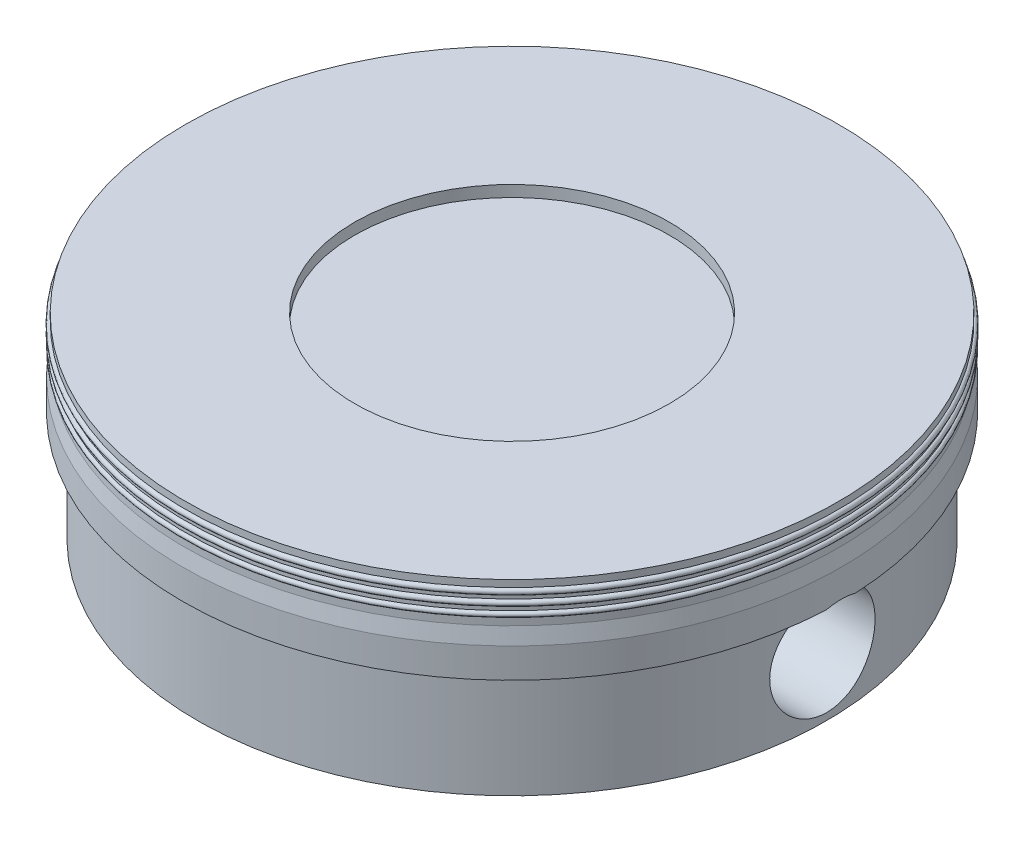
ISO-10303-21;
HEADER;
FILE_DESCRIPTION(('STEP AP214'),'2;1');
FILE_NAME('part.step','',(''),(''),'','','');
FILE_SCHEMA(('AUTOMOTIVE_DESIGN { 1 0 10303 214 1 1 1 1 }'));
ENDSEC;
DATA;
#1=APPLICATION_CONTEXT('core data for automotive mechanical design processes');
#2=APPLICATION_PROTOCOL_DEFINITION('international standard','automotive_design',2000,#1);
#3=PRODUCT_CONTEXT('',#1,'mechanical');
#4=PRODUCT('Part','Part','',(#3));
#5=PRODUCT_RELATED_PRODUCT_CATEGORY('part','',(#4));
#6=PRODUCT_DEFINITION_FORMATION('','',#4);
#7=PRODUCT_DEFINITION_CONTEXT('part definition',#1,'design');
#8=PRODUCT_DEFINITION('design','',#6,#7);
#9=PRODUCT_DEFINITION_SHAPE('','',#8);
#10=(LENGTH_UNIT() NAMED_UNIT(*) SI_UNIT(.MILLI.,.METRE.));
#11=(NAMED_UNIT(*) PLANE_ANGLE_UNIT() SI_UNIT($,.RADIAN.));
#12=(NAMED_UNIT(*) SI_UNIT($,.STERADIAN.) SOLID_ANGLE_UNIT());
#13=UNCERTAINTY_MEASURE_WITH_UNIT(LENGTH_MEASURE(1.E-05),#10,'distance_accuracy_value','');
#14=(GEOMETRIC_REPRESENTATION_CONTEXT(3) GLOBAL_UNCERTAINTY_ASSIGNED_CONTEXT((#13)) GLOBAL_UNIT_ASSIGNED_CONTEXT((#10,
#11,#12)) REPRESENTATION_CONTEXT('',''));
#15=CARTESIAN_POINT('',(0.,0.,0.));
#16=DIRECTION('',(0.,0.,1.));
#17=DIRECTION('',(1.,0.,0.));
#18=AXIS2_PLACEMENT_3D('',#15,#16,#17);
#19=CARTESIAN_POINT('',(5.00002397319986,16.3941782883623,-8.45895883470329E-08));
#20=DIRECTION('',(0.,1.,0.));
#21=DIRECTION('',(-1.,0.,0.));
#22=AXIS2_PLACEMENT_3D('',#19,#20,#21);
#23=PLANE('',#22);
#24=CARTESIAN_POINT('',(2.39731998639205E-05,16.3941782883623,-8.45895883470329E-08));
#25=DIRECTION('',(0.,1.,0.));
#26=DIRECTION('',(-1.,0.,0.));
#27=AXIS2_PLACEMENT_3D('',#24,#25,#26);
#28=CIRCLE('',#27,5.);
#29=CARTESIAN_POINT('',(-4.99503280825918,16.3941782883623,0.222278456884839));
#30=VERTEX_POINT('',#29);
#31=CARTESIAN_POINT('',(4.99508075465891,16.3941782883623,0.222278456884839));
#32=VERTEX_POINT('',#31);
#33=EDGE_CURVE('E144',#30,#32,#28,.T.);
#34=ORIENTED_EDGE('',*,*,#33,.F.);
#35=DIRECTION('',(1.,0.,0.));
#36=VECTOR('',#35,1.);
#37=CARTESIAN_POINT('',(-5.0051424957185,16.3941782883623,0.222278456884839));
#38=LINE('',#37,#36);
#39=CARTESIAN_POINT('',(-4.77480505515288,16.3941782883623,0.222278456884839));
#40=VERTEX_POINT('',#39);
#41=EDGE_CURVE('E70',#30,#40,#38,.T.);
#42=ORIENTED_EDGE('',*,*,#41,.T.);
#43=CARTESIAN_POINT('',(2.39731998639205E-05,16.3941782883623,-8.45895883470329E-08));
#44=DIRECTION('',(0.,1.,0.));
#45=DIRECTION('',(-1.,0.,0.));
#46=AXIS2_PLACEMENT_3D('',#43,#44,#45);
#47=CIRCLE('',#46,4.78);
#48=CARTESIAN_POINT('',(4.77485300155261,16.3941782883623,0.222278456884839));
#49=VERTEX_POINT('',#48);
#50=EDGE_CURVE('E11',#40,#49,#47,.T.);
#51=ORIENTED_EDGE('',*,*,#50,.T.);
#52=EDGE_CURVE('E271',#49,#32,#38,.T.);
#53=ORIENTED_EDGE('',*,*,#52,.T.);
#54=EDGE_LOOP('',(#34,#42,#51,#53));
#55=FACE_BOUND('',#54,.T.);
#56=ADVANCED_FACE('F44',(#55),#23,.F.);
#57=CARTESIAN_POINT('',(2.39731998640258E-05,17.7191782883623,-8.45895883470329E-08));
#58=DIRECTION('',(0.,1.,0.));
#59=DIRECTION('',(-1.,0.,0.));
#60=AXIS2_PLACEMENT_3D('',#57,#58,#59);
#61=CYLINDRICAL_SURFACE('',#60,3.43);
#62=CARTESIAN_POINT('',(2.39731998639407E-05,16.6491782883623,-8.45895883470329E-08));
#63=DIRECTION('',(0.,1.,0.));
#64=DIRECTION('',(-1.,0.,0.));
#65=AXIS2_PLACEMENT_3D('',#62,#63,#64);
#66=CIRCLE('',#65,3.43);
#67=CARTESIAN_POINT('',(-1.74997602680014,16.6491782883623,2.94998296620918));
#68=VERTEX_POINT('',#67);
#69=CARTESIAN_POINT('',(1.75002397319986,16.6491782883623,2.94998296620918));
#70=VERTEX_POINT('',#69);
#71=EDGE_CURVE('E200',#68,#70,#66,.T.);
#72=ORIENTED_EDGE('',*,*,#71,.T.);
#73=DIRECTION('',(0.,-1.,0.));
#74=VECTOR('',#73,1.);
#75=CARTESIAN_POINT('',(1.75002397319986,17.6913782883623,2.94998296620918));
#76=LINE('',#75,#74);
#77=CARTESIAN_POINT('',(1.75002397319986,14.7191782883623,2.94998296620918));
#78=VERTEX_POINT('',#77);
#79=EDGE_CURVE('E258',#70,#78,#76,.T.);
#80=ORIENTED_EDGE('',*,*,#79,.T.);
#81=CARTESIAN_POINT('',(2.39731998637873E-05,14.7191782883623,-8.45895883470329E-08));
#82=DIRECTION('',(0.,1.,0.));
#83=DIRECTION('',(-1.,0.,0.));
#84=AXIS2_PLACEMENT_3D('',#81,#82,#83);
#85=CIRCLE('',#84,3.43);
#86=CARTESIAN_POINT('',(-1.74997602680014,14.7191782883623,2.94998296620918));
#87=VERTEX_POINT('',#86);
#88=EDGE_CURVE('E205',#87,#78,#85,.T.);
#89=ORIENTED_EDGE('',*,*,#88,.F.);
#90=DIRECTION('',(0.,-1.,0.));
#91=VECTOR('',#90,1.);
#92=CARTESIAN_POINT('',(-1.74997602680014,17.6913782883623,2.94998296620918));
#93=LINE('',#92,#91);
#94=EDGE_CURVE('E223',#68,#87,#93,.T.);
#95=ORIENTED_EDGE('',*,*,#94,.F.);
#96=EDGE_LOOP('',(#72,#80,#89,#95));
#97=FACE_BOUND('',#96,.T.);
#98=ADVANCED_FACE('F311',(#97),#61,.F.);
#99=CARTESIAN_POINT('',(2.39731998640258E-05,17.7191782883623,-8.45895883470329E-08));
#100=DIRECTION('',(0.,1.,0.));
#101=DIRECTION('',(-1.,0.,0.));
#102=AXIS2_PLACEMENT_3D('',#99,#100,#101);
#103=CYLINDRICAL_SURFACE('',#102,4.78);
#104=ORIENTED_EDGE('',*,*,#50,.F.);
#105=CARTESIAN_POINT('',(-4.77480505515288,16.3941782883623,0.222278456884839));
#106=CARTESIAN_POINT('',(-4.77280669108975,16.3816958887688,0.265565519759989));
#107=CARTESIAN_POINT('',(-4.77023725644197,16.3655034716094,0.30773064911584));
#108=CARTESIAN_POINT('',(-4.76431560364256,16.3263434688303,0.388679653843705));
#109=CARTESIAN_POINT('',(-4.76096416574928,16.3033826305546,0.427466846984932));
#110=CARTESIAN_POINT('',(-4.75383186240648,16.2512988698889,0.500619264751559));
#111=CARTESIAN_POINT('',(-4.7500509230328,16.2221748859752,0.534983725975479));
#112=CARTESIAN_POINT('',(-4.74248542764722,16.1585871188541,0.598348968178687));
#113=CARTESIAN_POINT('',(-4.73870087185624,16.1241236434017,0.62735005807813));
#114=CARTESIAN_POINT('',(-4.73153105199467,16.0505967978468,0.679324649147275));
#115=CARTESIAN_POINT('',(-4.72814803519442,16.0115097784166,0.7022650332023));
#116=CARTESIAN_POINT('',(-4.7221940900473,15.9299717909658,0.741247005562128));
#117=CARTESIAN_POINT('',(-4.7196232068545,15.8875206360657,0.757288210295281));
#118=CARTESIAN_POINT('',(-4.71561004607263,15.8007929602562,0.781889542998554));
#119=CARTESIAN_POINT('',(-4.71415951486775,15.7565323678611,0.790504436248471));
#120=CARTESIAN_POINT('',(-4.71252603386343,15.6671738010784,0.800185690690471));
#121=CARTESIAN_POINT('',(-4.71234291934102,15.6220759362729,0.801253032819334));
#122=CARTESIAN_POINT('',(-4.7132599560872,15.5328769879509,0.795839970430003));
#123=CARTESIAN_POINT('',(-4.71434524129296,15.4887704103273,0.789447004499236));
#124=CARTESIAN_POINT('',(-4.71764953379241,15.402267007407,0.769453112958443));
#125=CARTESIAN_POINT('',(-4.71986858235978,15.3598702444154,0.755851924938632));
#126=CARTESIAN_POINT('',(-4.7251951772583,15.2778617248379,0.721803093605542));
#127=CARTESIAN_POINT('',(-4.72830488823174,15.2382570499007,0.701338749291105));
#128=CARTESIAN_POINT('',(-4.7350629086676,15.1630186310224,0.654154523286948));
#129=CARTESIAN_POINT('',(-4.73871125949659,15.1273851924341,0.627434161054111));
#130=CARTESIAN_POINT('',(-4.74619261204456,15.0606223274712,0.568094463058484));
#131=CARTESIAN_POINT('',(-4.75002736759582,15.0295556854415,0.53540467832031));
#132=CARTESIAN_POINT('',(-4.75740997643784,14.9733312091637,0.465256660119838));
#133=CARTESIAN_POINT('',(-4.76095782259372,14.9481735218303,0.427798308132122));
#134=CARTESIAN_POINT('',(-4.76738145792898,14.9044110350176,0.349013505367648));
#135=CARTESIAN_POINT('',(-4.77025500818989,14.885827964909,0.307674788962026));
#136=CARTESIAN_POINT('',(-4.7749899259292,14.8558875371759,0.222404116923841));
#137=CARTESIAN_POINT('',(-4.77685137317378,14.8445296101092,0.178472365956962));
#138=CARTESIAN_POINT('',(-4.77933648991169,14.8294738542403,0.0897762342545006));
#139=CARTESIAN_POINT('',(-4.77997347486101,14.8256936021919,0.0450262158315295));
#140=CARTESIAN_POINT('',(-4.77997856283902,14.8256630695401,-0.0444749829692401));
#141=CARTESIAN_POINT('',(-4.77934673237908,14.8294123942357,-0.0892261631631699));
#142=CARTESIAN_POINT('',(-4.77689535932621,14.844262556971,-0.177083626135516));
#143=CARTESIAN_POINT('',(-4.77508542398646,14.8553039400248,-0.220200254382042));
#144=CARTESIAN_POINT('',(-4.77048608560248,14.8843480365439,-0.303965157722445));
#145=CARTESIAN_POINT('',(-4.76769663791794,14.9023510672832,-0.344613320219398));
#146=CARTESIAN_POINT('',(-4.76141950127179,14.9449513197157,-0.422610370722021));
#147=CARTESIAN_POINT('',(-4.75792699345644,14.9695944714633,-0.459933773287706));
#148=CARTESIAN_POINT('',(-4.75063888437633,15.0247271584847,-0.529946763729266));
#149=CARTESIAN_POINT('',(-4.7468432596472,15.0552171466206,-0.562635992327592));
#150=CARTESIAN_POINT('',(-4.73932198329045,15.1215973129025,-0.622842770847944));
#151=CARTESIAN_POINT('',(-4.73559764185306,15.1575456662741,-0.650296390484024));
#152=CARTESIAN_POINT('',(-4.72868665910591,15.2335871682175,-0.698783136368884));
#153=CARTESIAN_POINT('',(-4.72550001386543,15.2736802864866,-0.71981630955379));
#154=CARTESIAN_POINT('',(-4.72003650591244,15.3568172718967,-0.754814012095185));
#155=CARTESIAN_POINT('',(-4.71775802686867,15.399855735517,-0.768791111603112));
#156=CARTESIAN_POINT('',(-4.71436987508637,15.4877134993989,-0.789303653559921));
#157=CARTESIAN_POINT('',(-4.71326007400948,15.5325326035583,-0.795839913131002));
#158=CARTESIAN_POINT('',(-4.71234635539527,15.6220730916451,-0.80123244862053));
#159=CARTESIAN_POINT('',(-4.71252610122047,15.6667885438812,-0.800184799825682));
#160=CARTESIAN_POINT('',(-4.71413184036416,15.7554009708773,-0.790669261853999));
#161=CARTESIAN_POINT('',(-4.71555787542941,15.7992979181697,-0.782201124114232));
#162=CARTESIAN_POINT('',(-4.71948434379134,15.8848709088494,-0.758147570603225));
#163=CARTESIAN_POINT('',(-4.72198087784179,15.926554401289,-0.742587972357526));
#164=CARTESIAN_POINT('',(-4.7277657747901,16.0067244316034,-0.704817474038438));
#165=CARTESIAN_POINT('',(-4.73105409650208,16.0452111356233,-0.682606919908617));
#166=CARTESIAN_POINT('',(-4.73809739985523,16.1183615923966,-0.631874866887768));
#167=CARTESIAN_POINT('',(-4.74185713477228,16.1529784236136,-0.60328637067043));
#168=CARTESIAN_POINT('',(-4.74939752966274,16.216959948701,-0.540730742093716));
#169=CARTESIAN_POINT('',(-4.75317819325455,16.2463237031366,-0.506762649716964));
#170=CARTESIAN_POINT('',(-4.76045425905028,16.2998363845848,-0.43317669504273));
#171=CARTESIAN_POINT('',(-4.76393630467713,16.3237835772609,-0.393410497799578));
#172=CARTESIAN_POINT('',(-4.77008383415393,16.3645330489253,-0.31025568984645));
#173=CARTESIAN_POINT('',(-4.77274829221484,16.3813263624435,-0.266862614765071));
#174=CARTESIAN_POINT('',(-4.77480505515288,16.3941782883623,-0.222278626064016));
#175=B_SPLINE_CURVE_WITH_KNOTS('',3,(#105,#106,#107,#108,#109,#110,#111,#112,#113,#114,#115,
#116,#117,#118,#119,#120,#121,#122,#123,#124,#125,#126,#127,#128,#129,#130,#131,#132,#133,#134,
#135,#136,#137,#138,#139,#140,#141,#142,#143,#144,#145,#146,#147,#148,#149,#150,#151,#152,#153,
#154,#155,#156,#157,#158,#159,#160,#161,#162,#163,#164,#165,#166,#167,#168,#169,#170,#171,#172,
#173,#174),.UNSPECIFIED.,.F.,.F.,(4,2,2,2,2,2,2,2,2,2,2,2,2,2,2,2,2,2,2,2,2,2,2,2,2,2,2,2,2,2,2,
2,2,2,4),(0.,0.135088002090542,0.270041789656699,0.405018840252149,0.539988113998976,
0.675680313048405,0.81138005516234,0.946070303482859,1.08074304611908,1.21385307747076,
1.34696795492374,1.48040913713284,1.61386057271599,1.74900279635995,1.88414837969582,
2.01973654129895,2.15531401533477,2.28940861700713,2.42349618961656,2.55650377224967,
2.68951741735821,2.82347585452539,2.95744467152932,3.09295713370618,3.22846860520704,
3.36373780819787,3.49899215505212,3.63253608442342,3.76608448726538,3.89915052374366,
4.032209640112,4.16673845047392,4.30129129532136,4.44024045581717,4.57936324317912),.UNSPECIFIED.);
#176=CARTESIAN_POINT('',(-4.77480505515288,16.3941782883623,-0.222278626064016));
#177=VERTEX_POINT('',#176);
#178=EDGE_CURVE('E293',#40,#177,#175,.T.);
#179=ORIENTED_EDGE('',*,*,#178,.T.);
#180=CARTESIAN_POINT('',(4.77485300155261,16.3941782883623,-0.222278626064016));
#181=VERTEX_POINT('',#180);
#182=EDGE_CURVE('E55',#181,#177,#47,.T.);
#183=ORIENTED_EDGE('',*,*,#182,.F.);
#184=CARTESIAN_POINT('',(4.77485300155261,16.3941782883623,-0.222278626064015));
#185=CARTESIAN_POINT('',(4.77285463748948,16.3816958887688,-0.265565688939166));
#186=CARTESIAN_POINT('',(4.7702852028417,16.3655034716094,-0.307730818295017));
#187=CARTESIAN_POINT('',(4.76436355004229,16.3263434688303,-0.388679823022881));
#188=CARTESIAN_POINT('',(4.761012112149,16.3033826305546,-0.427467016164109));
#189=CARTESIAN_POINT('',(4.75387980880621,16.2512988698889,-0.500619433930735));
#190=CARTESIAN_POINT('',(4.75009886943253,16.2221748859752,-0.534983895154656));
#191=CARTESIAN_POINT('',(4.74253337404695,16.1585871188541,-0.598349137357863));
#192=CARTESIAN_POINT('',(4.73874881825597,16.1241236434017,-0.627350227257307));
#193=CARTESIAN_POINT('',(4.73157899839439,16.0505967978468,-0.679324818326452));
#194=CARTESIAN_POINT('',(4.72819598159415,16.0115097784166,-0.702265202381476));
#195=CARTESIAN_POINT('',(4.72224203644703,15.9299717909658,-0.741247174741304));
#196=CARTESIAN_POINT('',(4.71967115325423,15.8875206360657,-0.757288379474458));
#197=CARTESIAN_POINT('',(4.71565799247236,15.8007929602562,-0.781889712177732));
#198=CARTESIAN_POINT('',(4.71420746126747,15.7565323678611,-0.790504605427648));
#199=CARTESIAN_POINT('',(4.71257398026316,15.6671738010784,-0.800185859869648));
#200=CARTESIAN_POINT('',(4.71239086574074,15.6220759362729,-0.80125320199851));
#201=CARTESIAN_POINT('',(4.71330790248693,15.5328769879509,-0.79584013960918));
#202=CARTESIAN_POINT('',(4.71439318769269,15.4887704103273,-0.789447173678413));
#203=CARTESIAN_POINT('',(4.71769748019214,15.402267007407,-0.76945328213762));
#204=CARTESIAN_POINT('',(4.7199165287595,15.3598702444154,-0.755852094117808));
#205=CARTESIAN_POINT('',(4.72524312365802,15.2778617248379,-0.721803262784718));
#206=CARTESIAN_POINT('',(4.72835283463146,15.2382570499007,-0.701338918470282));
#207=CARTESIAN_POINT('',(4.73511085506733,15.1630186310224,-0.654154692466125));
#208=CARTESIAN_POINT('',(4.73875920589632,15.1273851924341,-0.627434330233288));
#209=CARTESIAN_POINT('',(4.74624055844429,15.0606223274712,-0.56809463223766));
#210=CARTESIAN_POINT('',(4.75007531399555,15.0295556854415,-0.535404847499486));
#211=CARTESIAN_POINT('',(4.75745792283757,14.9733312091637,-0.465256829299013));
#212=CARTESIAN_POINT('',(4.76100576899344,14.9481735218303,-0.427798477311298));
#213=CARTESIAN_POINT('',(4.7674294043287,14.9044110350176,-0.349013674546825));
#214=CARTESIAN_POINT('',(4.77030295458962,14.885827964909,-0.307674958141204));
#215=CARTESIAN_POINT('',(4.77503787232893,14.8558875371759,-0.222404286103018));
#216=CARTESIAN_POINT('',(4.77689931957351,14.8445296101092,-0.178472535136139));
#217=CARTESIAN_POINT('',(4.77938443631142,14.8294738542403,-0.0897764034336775));
#218=CARTESIAN_POINT('',(4.78002142126074,14.8256936021919,-0.0450263850107064));
#219=CARTESIAN_POINT('',(4.78002650923875,14.8256630695401,0.0444748137900631));
#220=CARTESIAN_POINT('',(4.77939467877881,14.8294123942357,0.089225993983993));
#221=CARTESIAN_POINT('',(4.77694330572593,14.844262556971,0.177083456956339));
#222=CARTESIAN_POINT('',(4.77513337038619,14.8553039400248,0.220200085202866));
#223=CARTESIAN_POINT('',(4.7705340320022,14.8843480365439,0.303964988543269));
#224=CARTESIAN_POINT('',(4.76774458431766,14.9023510672832,0.344613151040221));
#225=CARTESIAN_POINT('',(4.76146744767152,14.9449513197157,0.422610201542844));
#226=CARTESIAN_POINT('',(4.75797493985617,14.9695944714633,0.45993360410853));
#227=CARTESIAN_POINT('',(4.75068683077606,15.0247271584847,0.529946594550089));
#228=CARTESIAN_POINT('',(4.74689120604693,15.0552171466206,0.562635823148415));
#229=CARTESIAN_POINT('',(4.73936992969018,15.1215973129025,0.622842601668767));
#230=CARTESIAN_POINT('',(4.73564558825279,15.1575456662741,0.650296221304847));
#231=CARTESIAN_POINT('',(4.72873460550563,15.2335871682175,0.698782967189707));
#232=CARTESIAN_POINT('',(4.72554796026516,15.2736802864866,0.719816140374613));
#233=CARTESIAN_POINT('',(4.72008445231217,15.3568172718967,0.754813842916008));
#234=CARTESIAN_POINT('',(4.7178059732684,15.399855735517,0.768790942423935));
#235=CARTESIAN_POINT('',(4.7144178214861,15.4877134993989,0.789303484380744));
#236=CARTESIAN_POINT('',(4.7133080204092,15.5325326035583,0.795839743951825));
#237=CARTESIAN_POINT('',(4.71239430179499,15.6220730916451,0.801232279441353));
#238=CARTESIAN_POINT('',(4.71257404762019,15.6667885438812,0.800184630646505));
#239=CARTESIAN_POINT('',(4.71417978676389,15.7554009708773,0.790669092674823));
#240=CARTESIAN_POINT('',(4.71560582182914,15.7992979181697,0.782200954935055));
#241=CARTESIAN_POINT('',(4.71953229019106,15.8848709088494,0.758147401424048));
#242=CARTESIAN_POINT('',(4.72202882424152,15.926554401289,0.742587803178349));
#243=CARTESIAN_POINT('',(4.72781372118983,16.0067244316034,0.704817304859261));
#244=CARTESIAN_POINT('',(4.73110204290181,16.0452111356233,0.682606750729441));
#245=CARTESIAN_POINT('',(4.73814534625496,16.1183615923966,0.631874697708592));
#246=CARTESIAN_POINT('',(4.741905081172,16.1529784236136,0.603286201491253));
#247=CARTESIAN_POINT('',(4.74944547606246,16.216959948701,0.54073057291454));
#248=CARTESIAN_POINT('',(4.75322613965427,16.2463237031366,0.506762480537787));
#249=CARTESIAN_POINT('',(4.76050220545,16.2998363845848,0.433176525863553));
#250=CARTESIAN_POINT('',(4.76398425107686,16.3237835772609,0.393410328620402));
#251=CARTESIAN_POINT('',(4.77013178055365,16.3645330489253,0.310255520667274));
#252=CARTESIAN_POINT('',(4.77279623861457,16.3813263624435,0.266862445585895));
#253=CARTESIAN_POINT('',(4.77485300155261,16.3941782883623,0.222278456884839));
#254=B_SPLINE_CURVE_WITH_KNOTS('',3,(#184,#185,#186,#187,#188,#189,#190,#191,#192,#193,#194,
#195,#196,#197,#198,#199,#200,#201,#202,#203,#204,#205,#206,#207,#208,#209,#210,#211,#212,#213,
#214,#215,#216,#217,#218,#219,#220,#221,#222,#223,#224,#225,#226,#227,#228,#229,#230,#231,#232,
#233,#234,#235,#236,#237,#238,#239,#240,#241,#242,#243,#244,#245,#246,#247,#248,#249,#250,#251,
#252,#253),.UNSPECIFIED.,.F.,.F.,(4,2,2,2,2,2,2,2,2,2,2,2,2,2,2,2,2,2,2,2,2,2,2,2,2,2,2,2,2,2,2,
2,2,2,4),(0.,0.135088002090542,0.2700417896567,0.405018840252149,0.539988113998976,
0.675680313048408,0.81138005516234,0.946070303482859,1.08074304611908,1.21385307747076,
1.34696795492373,1.48040913713284,1.61386057271599,1.74900279635995,1.88414837969582,
2.01973654129895,2.15531401533477,2.28940861700713,2.42349618961656,2.55650377224967,
2.68951741735821,2.82347585452539,2.95744467152932,3.09295713370618,3.22846860520704,
3.36373780819787,3.49899215505212,3.63253608442342,3.76608448726538,3.89915052374366,
4.032209640112,4.16673845047392,4.30129129532136,4.44024045581716,4.57936324317912),.UNSPECIFIED.);
#255=EDGE_CURVE('E254',#181,#49,#254,.T.);
#256=ORIENTED_EDGE('',*,*,#255,.T.);
#257=EDGE_LOOP('',(#104,#179,#183,#256));
#258=FACE_BOUND('',#257,.T.);
#259=CARTESIAN_POINT('',(2.39731998637873E-05,14.7191782883623,-8.45895883470329E-08));
#260=DIRECTION('',(0.,1.,0.));
#261=DIRECTION('',(-1.,0.,0.));
#262=AXIS2_PLACEMENT_3D('',#259,#260,#261);
#263=CIRCLE('',#262,4.78);
#264=CARTESIAN_POINT('',(-4.77997602680014,14.7191782883623,-8.45895883470329E-08));
#265=VERTEX_POINT('',#264);
#266=EDGE_CURVE('E210',#265,#265,#263,.T.);
#267=ORIENTED_EDGE('',*,*,#266,.T.);
#268=EDGE_LOOP('',(#267));
#269=FACE_BOUND('',#268,.T.);
#270=ADVANCED_FACE('F46',(#258,#269),#103,.T.);
#271=CARTESIAN_POINT('',(4.99508075465891,16.3941782883623,-0.222278626064015));
#272=VERTEX_POINT('',#271);
#273=CARTESIAN_POINT('',(-4.99503280825918,16.3941782883623,-0.222278626064015));
#274=VERTEX_POINT('',#273);
#275=EDGE_CURVE('E137',#272,#274,#28,.T.);
#276=ORIENTED_EDGE('',*,*,#275,.F.);
#277=DIRECTION('',(1.,0.,0.));
#278=VECTOR('',#277,1.);
#279=CARTESIAN_POINT('',(-5.0051424957185,16.3941782883623,-0.222278626064016));
#280=LINE('',#279,#278);
#281=EDGE_CURVE('E62',#272,#181,#280,.F.);
#282=ORIENTED_EDGE('',*,*,#281,.T.);
#283=ORIENTED_EDGE('',*,*,#182,.T.);
#284=EDGE_CURVE('E124',#177,#274,#280,.F.);
#285=ORIENTED_EDGE('',*,*,#284,.T.);
#286=EDGE_LOOP('',(#276,#282,#283,#285));
#287=FACE_BOUND('',#286,.T.);
#288=ADVANCED_FACE('F136',(#287),#23,.F.);
#289=CARTESIAN_POINT('',(2.39731998640258E-05,17.7191782883623,-8.45895883470329E-08));
#290=DIRECTION('',(0.,1.,0.));
#291=DIRECTION('',(-1.,0.,0.));
#292=AXIS2_PLACEMENT_3D('',#289,#290,#291);
#293=CYLINDRICAL_SURFACE('',#292,5.);
#294=CARTESIAN_POINT('',(2.39731998639564E-05,16.8457873987181,-8.45895883470329E-08));
#295=DIRECTION('',(0.,1.,0.));
#296=DIRECTION('',(-1.,0.,0.));
#297=AXIS2_PLACEMENT_3D('',#294,#295,#296);
#298=CIRCLE('',#297,5.);
#299=CARTESIAN_POINT('',(-4.99997602680014,16.8457873987181,-8.45895883470329E-08));
#300=VERTEX_POINT('',#299);
#301=EDGE_CURVE('E145',#300,#300,#298,.T.);
#302=ORIENTED_EDGE('',*,*,#301,.F.);
#303=EDGE_LOOP('',(#302));
#304=FACE_BOUND('',#303,.T.);
#305=ORIENTED_EDGE('',*,*,#33,.T.);
#306=CARTESIAN_POINT('',(4.99508075465891,16.3941782883623,0.222278456884839));
#307=CARTESIAN_POINT('',(4.99604321486238,16.4004292024518,0.200664704338253));
#308=CARTESIAN_POINT('',(4.99687501915872,16.405766737619,0.178793872327018));
#309=CARTESIAN_POINT('',(4.99825879998799,16.414583658096,0.13466791202046));
#310=CARTESIAN_POINT('',(4.99881072353854,16.4180626915918,0.112412711786866));
#311=CARTESIAN_POINT('',(4.99999876253568,16.4255382584898,0.0463701350645826));
#312=CARTESIAN_POINT('',(5.00021559942708,16.4268793252873,0.00223726586920053));
#313=CARTESIAN_POINT('',(4.99959812436655,16.4230131897211,-0.0719868425852147));
#314=CARTESIAN_POINT('',(4.99906814996195,16.4197028301053,-0.102199681715688));
#315=CARTESIAN_POINT('',(4.99747491681166,16.4096000192673,-0.162537781089389));
#316=CARTESIAN_POINT('',(4.99640298377162,16.4027508879965,-0.19265333002206));
#317=CARTESIAN_POINT('',(4.99508075465891,16.3941782883623,-0.222278626064015));
#318=B_SPLINE_CURVE_WITH_KNOTS('',3,(#306,#307,#308,#309,#310,#311,#312,#313,#314,#315,#316,
#317),.UNSPECIFIED.,.F.,.F.,(4,2,2,2,2,4),(0.,0.0675150206754097,0.135042817403799,
0.266802474171102,0.357814439020022,0.450331522475722),.UNSPECIFIED.);
#319=EDGE_CURVE('E142',#32,#272,#318,.T.);
#320=ORIENTED_EDGE('',*,*,#319,.T.);
#321=ORIENTED_EDGE('',*,*,#275,.T.);
#322=CARTESIAN_POINT('',(-4.99503280825918,16.3941782883623,-0.222278626064015));
#323=CARTESIAN_POINT('',(-4.99599526846265,16.4004292024518,-0.200664873517429));
#324=CARTESIAN_POINT('',(-4.996827072759,16.405766737619,-0.178794041506195));
#325=CARTESIAN_POINT('',(-4.99821085358826,16.414583658096,-0.134668081199636));
#326=CARTESIAN_POINT('',(-4.99876277713881,16.4180626915918,-0.112412880966042));
#327=CARTESIAN_POINT('',(-4.99995081613595,16.4255382584898,-0.0463703042437593));
#328=CARTESIAN_POINT('',(-5.00016765302736,16.4268793252873,-0.00223743504837723));
#329=CARTESIAN_POINT('',(-4.99955017796682,16.4230131897211,0.0719866734060381));
#330=CARTESIAN_POINT('',(-4.99902020356222,16.4197028301053,0.102199512536511));
#331=CARTESIAN_POINT('',(-4.99742697041193,16.4096000192673,0.162537611910212));
#332=CARTESIAN_POINT('',(-4.99635503737189,16.4027508879965,0.192653160842883));
#333=CARTESIAN_POINT('',(-4.99503280825918,16.3941782883623,0.222278456884839));
#334=B_SPLINE_CURVE_WITH_KNOTS('',3,(#322,#323,#324,#325,#326,#327,#328,#329,#330,#331,#332,
#333),.UNSPECIFIED.,.F.,.F.,(4,2,2,2,2,4),(0.,0.0675150206754097,0.135042817403799,
0.266802474171102,0.357814439020022,0.450331522475722),.UNSPECIFIED.);
#335=EDGE_CURVE('E121',#274,#30,#334,.T.);
#336=ORIENTED_EDGE('',*,*,#335,.T.);
#337=EDGE_LOOP('',(#305,#320,#321,#336));
#338=FACE_BOUND('',#337,.T.);
#339=ADVANCED_FACE('F141',(#304,#338),#293,.T.);
#340=CARTESIAN_POINT('',(2.39731998639564E-05,16.8457873987181,-8.45895883470329E-08));
#341=DIRECTION('',(0.,-1.,0.));
#342=DIRECTION('',(1.,0.,0.));
#343=AXIS2_PLACEMENT_3D('',#340,#341,#342);
#344=CONICAL_SURFACE('',#343,5.,0.167843531996844);
#345=CARTESIAN_POINT('',(2.39731998639751E-05,17.081862467154,-8.45895883470329E-08));
#346=DIRECTION('',(0.,1.,0.));
#347=DIRECTION('',(-1.,0.,0.));
#348=AXIS2_PLACEMENT_3D('',#345,#346,#347);
#349=CIRCLE('',#348,4.96);
#350=CARTESIAN_POINT('',(-4.95997602680014,17.081862467154,-8.45895883470329E-08));
#351=VERTEX_POINT('',#350);
#352=EDGE_CURVE('E150',#351,#351,#349,.T.);
#353=ORIENTED_EDGE('',*,*,#352,.F.);
#354=EDGE_LOOP('',(#353));
#355=FACE_BOUND('',#354,.T.);
#356=ORIENTED_EDGE('',*,*,#301,.T.);
#357=EDGE_LOOP('',(#356));
#358=FACE_BOUND('',#357,.T.);
#359=ADVANCED_FACE('F323',(#355,#358),#344,.T.);
#360=CARTESIAN_POINT('',(2.39731998640258E-05,17.7191782883623,-8.45895883470329E-08));
#361=DIRECTION('',(0.,1.,0.));
#362=DIRECTION('',(-1.,0.,0.));
#363=AXIS2_PLACEMENT_3D('',#360,#361,#362);
#364=CYLINDRICAL_SURFACE('',#363,4.96);
#365=CARTESIAN_POINT('',(2.39731998639846E-05,17.2011782883623,-8.45895883470329E-08));
#366=DIRECTION('',(0.,1.,0.));
#367=DIRECTION('',(-1.,0.,0.));
#368=AXIS2_PLACEMENT_3D('',#365,#366,#367);
#369=CIRCLE('',#368,4.96);
#370=CARTESIAN_POINT('',(-4.95997602680014,17.2011782883623,-8.45895883470329E-08));
#371=VERTEX_POINT('',#370);
#372=EDGE_CURVE('E156',#371,#371,#369,.T.);
#373=ORIENTED_EDGE('',*,*,#372,.F.);
#374=EDGE_LOOP('',(#373));
#375=FACE_BOUND('',#374,.T.);
#376=ORIENTED_EDGE('',*,*,#352,.T.);
#377=EDGE_LOOP('',(#376));
#378=FACE_BOUND('',#377,.T.);
#379=ADVANCED_FACE('F549',(#375,#378),#364,.T.);
#380=CARTESIAN_POINT('',(2.39731998637873E-05,17.2411782883623,-8.45895883470329E-08));
#381=DIRECTION('',(0.,1.,0.));
#382=DIRECTION('',(-1.,0.,0.));
#383=AXIS2_PLACEMENT_3D('',#380,#381,#382);
#384=TOROIDAL_SURFACE('',#383,4.96,0.0400000000000005);
#385=CARTESIAN_POINT('',(2.3973199863991E-05,17.2811782883623,-8.45895883470329E-08));
#386=DIRECTION('',(0.,1.,0.));
#387=DIRECTION('',(-1.,0.,0.));
#388=AXIS2_PLACEMENT_3D('',#385,#386,#387);
#389=CIRCLE('',#388,4.96);
#390=CARTESIAN_POINT('',(-4.95997602680014,17.2811782883623,-8.45895883470329E-08));
#391=VERTEX_POINT('',#390);
#392=EDGE_CURVE('E160',#391,#391,#389,.T.);
#393=ORIENTED_EDGE('',*,*,#392,.F.);
#394=EDGE_LOOP('',(#393));
#395=FACE_BOUND('',#394,.T.);
#396=ORIENTED_EDGE('',*,*,#372,.T.);
#397=EDGE_LOOP('',(#396));
#398=FACE_BOUND('',#397,.T.);
#399=ADVANCED_FACE('F538',(#395,#398),#384,.T.);
#400=CARTESIAN_POINT('',(2.39731998640258E-05,17.7191782883623,-8.45895883470329E-08));
#401=DIRECTION('',(0.,1.,0.));
#402=DIRECTION('',(-1.,0.,0.));
#403=AXIS2_PLACEMENT_3D('',#400,#401,#402);
#404=CYLINDRICAL_SURFACE('',#403,4.96);
#405=CARTESIAN_POINT('',(2.39731998639962E-05,17.3468652591555,-8.45895883470329E-08));
#406=DIRECTION('',(0.,1.,0.));
#407=DIRECTION('',(-1.,0.,0.));
#408=AXIS2_PLACEMENT_3D('',#405,#406,#407);
#409=CIRCLE('',#408,4.96);
#410=CARTESIAN_POINT('',(-4.95997602680014,17.3468652591555,-8.45895883470329E-08));
#411=VERTEX_POINT('',#410);
#412=EDGE_CURVE('E164',#411,#411,#409,.T.);
#413=ORIENTED_EDGE('',*,*,#412,.F.);
#414=EDGE_LOOP('',(#413));
#415=FACE_BOUND('',#414,.T.);
#416=ORIENTED_EDGE('',*,*,#392,.T.);
#417=EDGE_LOOP('',(#416));
#418=FACE_BOUND('',#417,.T.);
#419=ADVANCED_FACE('F528',(#415,#418),#404,.T.);
#420=CARTESIAN_POINT('',(2.39731998637873E-05,17.3911782883623,-8.45895883470329E-08));
#421=DIRECTION('',(0.,1.,0.));
#422=DIRECTION('',(-1.,0.,0.));
#423=AXIS2_PLACEMENT_3D('',#420,#421,#422);
#424=TOROIDAL_SURFACE('',#423,4.96,0.044313029206797);
#425=CARTESIAN_POINT('',(2.39731998640032E-05,17.4354913175691,-8.45895883470329E-08));
#426=DIRECTION('',(0.,1.,0.));
#427=DIRECTION('',(-1.,0.,0.));
#428=AXIS2_PLACEMENT_3D('',#425,#426,#427);
#429=CIRCLE('',#428,4.96);
#430=CARTESIAN_POINT('',(-4.95997602680014,17.4354913175691,-8.45895883470329E-08));
#431=VERTEX_POINT('',#430);
#432=EDGE_CURVE('E168',#431,#431,#429,.T.);
#433=ORIENTED_EDGE('',*,*,#432,.F.);
#434=EDGE_LOOP('',(#433));
#435=FACE_BOUND('',#434,.T.);
#436=ORIENTED_EDGE('',*,*,#412,.T.);
#437=EDGE_LOOP('',(#436));
#438=FACE_BOUND('',#437,.T.);
#439=ADVANCED_FACE('F517',(#435,#438),#424,.T.);
#440=CARTESIAN_POINT('',(2.39731998640258E-05,17.7191782883623,-8.45895883470329E-08));
#441=DIRECTION('',(0.,1.,0.));
#442=DIRECTION('',(-1.,0.,0.));
#443=AXIS2_PLACEMENT_3D('',#440,#441,#442);
#444=CYLINDRICAL_SURFACE('',#443,4.96);
#445=CARTESIAN_POINT('',(2.3973199864008E-05,17.496011819444,-8.45895883470329E-08));
#446=DIRECTION('',(0.,1.,0.));
#447=DIRECTION('',(-1.,0.,0.));
#448=AXIS2_PLACEMENT_3D('',#445,#446,#447);
#449=CIRCLE('',#448,4.96);
#450=CARTESIAN_POINT('',(-4.95997602680014,17.496011819444,-8.45895883470329E-08));
#451=VERTEX_POINT('',#450);
#452=EDGE_CURVE('E172',#451,#451,#449,.T.);
#453=ORIENTED_EDGE('',*,*,#452,.F.);
#454=EDGE_LOOP('',(#453));
#455=FACE_BOUND('',#454,.T.);
#456=ORIENTED_EDGE('',*,*,#432,.T.);
#457=EDGE_LOOP('',(#456));
#458=FACE_BOUND('',#457,.T.);
#459=ADVANCED_FACE('F507',(#455,#458),#444,.T.);
#460=CARTESIAN_POINT('',(2.39731998637873E-05,17.5411782883623,-8.45895883470329E-08));
#461=DIRECTION('',(0.,1.,0.));
#462=DIRECTION('',(-1.,0.,0.));
#463=AXIS2_PLACEMENT_3D('',#460,#461,#462);
#464=TOROIDAL_SURFACE('',#463,4.96,0.0451664689183659);
#465=CARTESIAN_POINT('',(2.39731998640152E-05,17.5863447572807,-8.45895883470329E-08));
#466=DIRECTION('',(0.,1.,0.));
#467=DIRECTION('',(-1.,0.,0.));
#468=AXIS2_PLACEMENT_3D('',#465,#466,#467);
#469=CIRCLE('',#468,4.96);
#470=CARTESIAN_POINT('',(-4.95997602680014,17.5863447572807,-8.45895883470329E-08));
#471=VERTEX_POINT('',#470);
#472=EDGE_CURVE('E176',#471,#471,#469,.T.);
#473=ORIENTED_EDGE('',*,*,#472,.F.);
#474=EDGE_LOOP('',(#473));
#475=FACE_BOUND('',#474,.T.);
#476=ORIENTED_EDGE('',*,*,#452,.T.);
#477=EDGE_LOOP('',(#476));
#478=FACE_BOUND('',#477,.T.);
#479=ADVANCED_FACE('F495',(#475,#478),#464,.T.);
#480=CARTESIAN_POINT('',(2.39731998640258E-05,17.7191782883623,-8.45895883470329E-08));
#481=DIRECTION('',(0.,1.,0.));
#482=DIRECTION('',(-1.,0.,0.));
#483=AXIS2_PLACEMENT_3D('',#480,#481,#482);
#484=CYLINDRICAL_SURFACE('',#483,4.96);
#485=CARTESIAN_POINT('',(2.39731998640236E-05,17.6911782883623,-8.45895883470329E-08));
#486=DIRECTION('',(0.,1.,0.));
#487=DIRECTION('',(-1.,0.,0.));
#488=AXIS2_PLACEMENT_3D('',#485,#486,#487);
#489=CIRCLE('',#488,4.96);
#490=CARTESIAN_POINT('',(-4.95997602680014,17.6911782883623,-8.45895883470329E-08));
#491=VERTEX_POINT('',#490);
#492=EDGE_CURVE('E180',#491,#491,#489,.T.);
#493=ORIENTED_EDGE('',*,*,#492,.F.);
#494=EDGE_LOOP('',(#493));
#495=FACE_BOUND('',#494,.T.);
#496=ORIENTED_EDGE('',*,*,#472,.T.);
#497=EDGE_LOOP('',(#496));
#498=FACE_BOUND('',#497,.T.);
#499=ADVANCED_FACE('F484',(#495,#498),#484,.T.);
#500=CARTESIAN_POINT('',(2.39002397319986,17.6911782883623,-8.45895883470329E-08));
#501=DIRECTION('',(0.,-1.,0.));
#502=DIRECTION('',(1.,0.,0.));
#503=AXIS2_PLACEMENT_3D('',#500,#501,#502);
#504=PLANE('',#503);
#505=CARTESIAN_POINT('',(2.39731998640236E-05,17.6911782883623,-8.45895883470329E-08));
#506=DIRECTION('',(0.,1.,0.));
#507=DIRECTION('',(-1.,0.,0.));
#508=AXIS2_PLACEMENT_3D('',#505,#506,#507);
#509=CIRCLE('',#508,2.39);
#510=CARTESIAN_POINT('',(-2.38997602680014,17.6911782883623,-8.45895883470329E-08));
#511=VERTEX_POINT('',#510);
#512=EDGE_CURVE('E184',#511,#511,#509,.T.);
#513=ORIENTED_EDGE('',*,*,#512,.F.);
#514=EDGE_LOOP('',(#513));
#515=FACE_BOUND('',#514,.T.);
#516=ORIENTED_EDGE('',*,*,#492,.T.);
#517=EDGE_LOOP('',(#516));
#518=FACE_BOUND('',#517,.T.);
#519=ADVANCED_FACE('F473',(#515,#518),#504,.F.);
#520=CARTESIAN_POINT('',(2.39731998640258E-05,17.7191782883623,-8.45895883470329E-08));
#521=DIRECTION('',(0.,1.,0.));
#522=DIRECTION('',(-1.,0.,0.));
#523=AXIS2_PLACEMENT_3D('',#520,#521,#522);
#524=CYLINDRICAL_SURFACE('',#523,2.39);
#525=CARTESIAN_POINT('',(2.39731998640099E-05,17.5191782883623,-8.45895883470329E-08));
#526=DIRECTION('',(0.,1.,0.));
#527=DIRECTION('',(-1.,0.,0.));
#528=AXIS2_PLACEMENT_3D('',#525,#526,#527);
#529=CIRCLE('',#528,2.39);
#530=CARTESIAN_POINT('',(-2.38997602680014,17.5191782883623,-8.45895883470329E-08));
#531=VERTEX_POINT('',#530);
#532=EDGE_CURVE('E188',#531,#531,#529,.T.);
#533=ORIENTED_EDGE('',*,*,#532,.F.);
#534=EDGE_LOOP('',(#533));
#535=FACE_BOUND('',#534,.T.);
#536=ORIENTED_EDGE('',*,*,#512,.T.);
#537=EDGE_LOOP('',(#536));
#538=FACE_BOUND('',#537,.T.);
#539=ADVANCED_FACE('F462',(#535,#538),#524,.F.);
#540=CARTESIAN_POINT('',(2.39731998636722E-05,17.5191782883623,-8.45895883470329E-08));
#541=DIRECTION('',(0.,-1.,0.));
#542=DIRECTION('',(1.,0.,0.));
#543=AXIS2_PLACEMENT_3D('',#540,#541,#542);
#544=PLANE('',#543);
#545=ORIENTED_EDGE('',*,*,#532,.T.);
#546=EDGE_LOOP('',(#545));
#547=FACE_BOUND('',#546,.T.);
#548=ADVANCED_FACE('F451',(#547),#544,.F.);
#549=CARTESIAN_POINT('',(4.20002397319986,17.0491782883623,-8.45895883470329E-08));
#550=DIRECTION('',(0.,1.,0.));
#551=DIRECTION('',(-1.,0.,0.));
#552=AXIS2_PLACEMENT_3D('',#549,#550,#551);
#553=PLANE('',#552);
#554=DIRECTION('',(0.,0.,-1.));
#555=VECTOR('',#554,1.);
#556=CARTESIAN_POINT('',(1.75002397319986,17.0491782883623,2.94998296620918));
#557=LINE('',#556,#555);
#558=CARTESIAN_POINT('',(1.75002397319986,17.0491782883623,2.94998296620918));
#559=VERTEX_POINT('',#558);
#560=CARTESIAN_POINT('',(1.75002397319986,17.0491782883623,-2.94998313538836));
#561=VERTEX_POINT('',#560);
#562=EDGE_CURVE('E246',#559,#561,#557,.T.);
#563=ORIENTED_EDGE('',*,*,#562,.F.);
#564=CARTESIAN_POINT('',(2.39731998639725E-05,17.0491782883623,-8.45895883470329E-08));
#565=DIRECTION('',(0.,1.,0.));
#566=DIRECTION('',(-1.,0.,0.));
#567=AXIS2_PLACEMENT_3D('',#564,#565,#566);
#568=CIRCLE('',#567,3.43);
#569=EDGE_CURVE('E242',#561,#559,#568,.F.);
#570=ORIENTED_EDGE('',*,*,#569,.F.);
#571=EDGE_LOOP('',(#563,#570));
#572=FACE_BOUND('',#571,.T.);
#573=DIRECTION('',(0.,0.,1.));
#574=VECTOR('',#573,1.);
#575=CARTESIAN_POINT('',(-1.74997602680014,17.0491782883623,2.94998296620918));
#576=LINE('',#575,#574);
#577=CARTESIAN_POINT('',(-1.74997602680014,17.0491782883623,-2.94998313538836));
#578=VERTEX_POINT('',#577);
#579=CARTESIAN_POINT('',(-1.74997602680014,17.0491782883623,2.94998296620918));
#580=VERTEX_POINT('',#579);
#581=EDGE_CURVE('E231',#578,#580,#576,.T.);
#582=ORIENTED_EDGE('',*,*,#581,.F.);
#583=CARTESIAN_POINT('',(2.39731998639725E-05,17.0491782883623,-8.45895883470329E-08));
#584=DIRECTION('',(0.,1.,0.));
#585=DIRECTION('',(-1.,0.,0.));
#586=AXIS2_PLACEMENT_3D('',#583,#584,#585);
#587=CIRCLE('',#586,3.43);
#588=EDGE_CURVE('E234',#580,#578,#587,.F.);
#589=ORIENTED_EDGE('',*,*,#588,.F.);
#590=EDGE_LOOP('',(#582,#589));
#591=FACE_BOUND('',#590,.T.);
#592=CARTESIAN_POINT('',(2.39731998639725E-05,17.0491782883623,-8.45895883470329E-08));
#593=DIRECTION('',(0.,1.,0.));
#594=DIRECTION('',(-1.,0.,0.));
#595=AXIS2_PLACEMENT_3D('',#592,#593,#594);
#596=CIRCLE('',#595,4.2);
#597=CARTESIAN_POINT('',(-4.19997602680014,17.0491782883623,-8.45895883470329E-08));
#598=VERTEX_POINT('',#597);
#599=EDGE_CURVE('E192',#598,#598,#596,.T.);
#600=ORIENTED_EDGE('',*,*,#599,.F.);
#601=EDGE_LOOP('',(#600));
#602=FACE_BOUND('',#601,.T.);
#603=ADVANCED_FACE('F440',(#572,#591,#602),#553,.F.);
#604=CARTESIAN_POINT('',(2.39731998640258E-05,17.7191782883623,-8.45895883470329E-08));
#605=DIRECTION('',(0.,1.,0.));
#606=DIRECTION('',(-1.,0.,0.));
#607=AXIS2_PLACEMENT_3D('',#604,#605,#606);
#608=CYLINDRICAL_SURFACE('',#607,4.2);
#609=CARTESIAN_POINT('',(2.39731998639407E-05,16.6491782883623,-8.45895883470329E-08));
#610=DIRECTION('',(0.,1.,0.));
#611=DIRECTION('',(-1.,0.,0.));
#612=AXIS2_PLACEMENT_3D('',#609,#610,#611);
#613=CIRCLE('',#612,4.2);
#614=CARTESIAN_POINT('',(-4.19997602680014,16.6491782883623,-8.45895883470329E-08));
#615=VERTEX_POINT('',#614);
#616=EDGE_CURVE('E196',#615,#615,#613,.T.);
#617=ORIENTED_EDGE('',*,*,#616,.F.);
#618=EDGE_LOOP('',(#617));
#619=FACE_BOUND('',#618,.T.);
#620=ORIENTED_EDGE('',*,*,#599,.T.);
#621=EDGE_LOOP('',(#620));
#622=FACE_BOUND('',#621,.T.);
#623=ADVANCED_FACE('F429',(#619,#622),#608,.F.);
#624=CARTESIAN_POINT('',(3.43002397319986,16.6491782883623,-8.45895883470329E-08));
#625=DIRECTION('',(0.,-1.,0.));
#626=DIRECTION('',(1.,0.,0.));
#627=AXIS2_PLACEMENT_3D('',#624,#625,#626);
#628=PLANE('',#627);
#629=ORIENTED_EDGE('',*,*,#71,.F.);
#630=CARTESIAN_POINT('',(2.39731998639407E-05,16.6491782883623,-8.45895883470329E-08));
#631=DIRECTION('',(0.,-1.,0.));
#632=DIRECTION('',(1.,0.,0.));
#633=AXIS2_PLACEMENT_3D('',#630,#631,#632);
#634=CIRCLE('',#633,3.43);
#635=CARTESIAN_POINT('',(-1.74997602680014,16.6491782883623,-2.94998313538836));
#636=VERTEX_POINT('',#635);
#637=EDGE_CURVE('E214',#68,#636,#634,.T.);
#638=ORIENTED_EDGE('',*,*,#637,.T.);
#639=CARTESIAN_POINT('',(1.75002397319986,16.6491782883623,-2.94998313538836));
#640=VERTEX_POINT('',#639);
#641=EDGE_CURVE('E204',#640,#636,#66,.T.);
#642=ORIENTED_EDGE('',*,*,#641,.F.);
#643=CARTESIAN_POINT('',(2.39731998639407E-05,16.6491782883623,-8.45895883470329E-08));
#644=DIRECTION('',(0.,-1.,0.));
#645=DIRECTION('',(1.,0.,0.));
#646=AXIS2_PLACEMENT_3D('',#643,#644,#645);
#647=CIRCLE('',#646,3.43);
#648=EDGE_CURVE('E238',#640,#70,#647,.T.);
#649=ORIENTED_EDGE('',*,*,#648,.T.);
#650=EDGE_LOOP('',(#629,#638,#642,#649));
#651=FACE_BOUND('',#650,.T.);
#652=ORIENTED_EDGE('',*,*,#616,.T.);
#653=EDGE_LOOP('',(#652));
#654=FACE_BOUND('',#653,.T.);
#655=ADVANCED_FACE('F418',(#651,#654),#628,.F.);
#656=CARTESIAN_POINT('',(1.75002397319986,14.7191782883623,-2.94998313538836));
#657=VERTEX_POINT('',#656);
#658=CARTESIAN_POINT('',(-1.74997602680014,14.7191782883623,-2.94998313538836));
#659=VERTEX_POINT('',#658);
#660=EDGE_CURVE('E209',#657,#659,#85,.T.);
#661=ORIENTED_EDGE('',*,*,#660,.F.);
#662=DIRECTION('',(0.,-1.,0.));
#663=VECTOR('',#662,1.);
#664=CARTESIAN_POINT('',(1.75002397319986,17.6913782883623,-2.94998313538836));
#665=LINE('',#664,#663);
#666=EDGE_CURVE('E253',#640,#657,#665,.T.);
#667=ORIENTED_EDGE('',*,*,#666,.F.);
#668=ORIENTED_EDGE('',*,*,#641,.T.);
#669=DIRECTION('',(0.,-1.,0.));
#670=VECTOR('',#669,1.);
#671=CARTESIAN_POINT('',(-1.74997602680014,17.6913782883623,-2.94998313538836));
#672=LINE('',#671,#670);
#673=EDGE_CURVE('E228',#636,#659,#672,.T.);
#674=ORIENTED_EDGE('',*,*,#673,.T.);
#675=EDGE_LOOP('',(#661,#667,#668,#674));
#676=FACE_BOUND('',#675,.T.);
#677=ADVANCED_FACE('F317',(#676),#61,.F.);
#678=CARTESIAN_POINT('',(4.78002397319986,14.7191782883623,-8.45895883470329E-08));
#679=DIRECTION('',(0.,1.,0.));
#680=DIRECTION('',(-1.,0.,0.));
#681=AXIS2_PLACEMENT_3D('',#678,#679,#680);
#682=PLANE('',#681);
#683=ORIENTED_EDGE('',*,*,#266,.F.);
#684=EDGE_LOOP('',(#683));
#685=FACE_BOUND('',#684,.T.);
#686=ORIENTED_EDGE('',*,*,#88,.T.);
#687=DIRECTION('',(0.,0.,-1.));
#688=VECTOR('',#687,1.);
#689=CARTESIAN_POINT('',(1.75002397319986,14.7191782883623,2.94998296620918));
#690=LINE('',#689,#688);
#691=EDGE_CURVE('E250',#78,#657,#690,.T.);
#692=ORIENTED_EDGE('',*,*,#691,.T.);
#693=ORIENTED_EDGE('',*,*,#660,.T.);
#694=DIRECTION('',(0.,0.,1.));
#695=VECTOR('',#694,1.);
#696=CARTESIAN_POINT('',(-1.74997602680014,14.7191782883623,2.94998296620918));
#697=LINE('',#696,#695);
#698=EDGE_CURVE('E218',#659,#87,#697,.T.);
#699=ORIENTED_EDGE('',*,*,#698,.T.);
#700=EDGE_LOOP('',(#686,#692,#693,#699));
#701=FACE_BOUND('',#700,.T.);
#702=ADVANCED_FACE('F398',(#685,#701),#682,.F.);
#703=CARTESIAN_POINT('',(2.39731998640236E-05,17.6913782883623,-8.45895883470329E-08));
#704=DIRECTION('',(0.,-1.,0.));
#705=DIRECTION('',(1.,0.,0.));
#706=AXIS2_PLACEMENT_3D('',#703,#704,#705);
#707=CYLINDRICAL_SURFACE('',#706,3.43);
#708=ORIENTED_EDGE('',*,*,#637,.F.);
#709=EDGE_CURVE('E219',#580,#68,#93,.T.);
#710=ORIENTED_EDGE('',*,*,#709,.F.);
#711=ORIENTED_EDGE('',*,*,#588,.T.);
#712=EDGE_CURVE('E224',#578,#636,#672,.T.);
#713=ORIENTED_EDGE('',*,*,#712,.T.);
#714=EDGE_LOOP('',(#708,#710,#711,#713));
#715=FACE_BOUND('',#714,.T.);
#716=ADVANCED_FACE('F387',(#715),#707,.T.);
#717=CARTESIAN_POINT('',(-1.74997602680014,17.6913782883623,2.94998296620918));
#718=DIRECTION('',(1.,0.,0.));
#719=DIRECTION('',(0.,1.,0.));
#720=AXIS2_PLACEMENT_3D('',#717,#718,#719);
#721=PLANE('',#720);
#722=CARTESIAN_POINT('',(-1.74997602680014,15.6256782883623,-8.45895883470329E-08));
#723=DIRECTION('',(1.,0.,0.));
#724=DIRECTION('',(0.,1.,0.));
#725=AXIS2_PLACEMENT_3D('',#722,#723,#724);
#726=CIRCLE('',#725,0.8);
#727=CARTESIAN_POINT('',(-1.74997602680014,16.4256782883623,-8.45895883470329E-08));
#728=VERTEX_POINT('',#727);
#729=EDGE_CURVE('E131',#728,#728,#726,.T.);
#730=ORIENTED_EDGE('',*,*,#729,.F.);
#731=EDGE_LOOP('',(#730));
#732=FACE_BOUND('',#731,.T.);
#733=ORIENTED_EDGE('',*,*,#712,.F.);
#734=ORIENTED_EDGE('',*,*,#581,.T.);
#735=ORIENTED_EDGE('',*,*,#709,.T.);
#736=ORIENTED_EDGE('',*,*,#94,.T.);
#737=ORIENTED_EDGE('',*,*,#698,.F.);
#738=ORIENTED_EDGE('',*,*,#673,.F.);
#739=EDGE_LOOP('',(#733,#734,#735,#736,#737,#738));
#740=FACE_BOUND('',#739,.T.);
#741=ADVANCED_FACE('F378',(#732,#740),#721,.T.);
#742=CARTESIAN_POINT('',(2.39731998640236E-05,17.6913782883623,-8.45895883470329E-08));
#743=DIRECTION('',(0.,-1.,0.));
#744=DIRECTION('',(1.,0.,0.));
#745=AXIS2_PLACEMENT_3D('',#742,#743,#744);
#746=CYLINDRICAL_SURFACE('',#745,3.43);
#747=ORIENTED_EDGE('',*,*,#648,.F.);
#748=EDGE_CURVE('E259',#561,#640,#665,.T.);
#749=ORIENTED_EDGE('',*,*,#748,.F.);
#750=ORIENTED_EDGE('',*,*,#569,.T.);
#751=EDGE_CURVE('E249',#559,#70,#76,.T.);
#752=ORIENTED_EDGE('',*,*,#751,.T.);
#753=EDGE_LOOP('',(#747,#749,#750,#752));
#754=FACE_BOUND('',#753,.T.);
#755=ADVANCED_FACE('F369',(#754),#746,.T.);
#756=CARTESIAN_POINT('',(1.75002397319986,17.6913782883623,2.94998296620918));
#757=DIRECTION('',(-1.,0.,0.));
#758=DIRECTION('',(0.,-1.,0.));
#759=AXIS2_PLACEMENT_3D('',#756,#757,#758);
#760=PLANE('',#759);
#761=CARTESIAN_POINT('',(1.75002397319986,15.6256782883623,-8.45895883470329E-08));
#762=DIRECTION('',(-1.,0.,0.));
#763=DIRECTION('',(0.,-1.,0.));
#764=AXIS2_PLACEMENT_3D('',#761,#762,#763);
#765=CIRCLE('',#764,0.8);
#766=CARTESIAN_POINT('',(1.75002397319986,14.8256782883623,-8.45895883470329E-08));
#767=VERTEX_POINT('',#766);
#768=EDGE_CURVE('E49',#767,#767,#765,.T.);
#769=ORIENTED_EDGE('',*,*,#768,.F.);
#770=EDGE_LOOP('',(#769));
#771=FACE_BOUND('',#770,.T.);
#772=ORIENTED_EDGE('',*,*,#751,.F.);
#773=ORIENTED_EDGE('',*,*,#562,.T.);
#774=ORIENTED_EDGE('',*,*,#748,.T.);
#775=ORIENTED_EDGE('',*,*,#666,.T.);
#776=ORIENTED_EDGE('',*,*,#691,.F.);
#777=ORIENTED_EDGE('',*,*,#79,.F.);
#778=EDGE_LOOP('',(#772,#773,#774,#775,#776,#777));
#779=FACE_BOUND('',#778,.T.);
#780=ADVANCED_FACE('F282',(#771,#779),#760,.T.);
#781=CARTESIAN_POINT('',(-5.0051424957185,15.6256782883623,-8.45895883470329E-08));
#782=DIRECTION('',(1.,0.,0.));
#783=DIRECTION('',(0.,0.,-1.));
#784=AXIS2_PLACEMENT_3D('',#781,#782,#783);
#785=CYLINDRICAL_SURFACE('',#784,0.8);
#786=ORIENTED_EDGE('',*,*,#768,.T.);
#787=EDGE_LOOP('',(#786));
#788=FACE_BOUND('',#787,.T.);
#789=ORIENTED_EDGE('',*,*,#281,.F.);
#790=ORIENTED_EDGE('',*,*,#319,.F.);
#791=ORIENTED_EDGE('',*,*,#52,.F.);
#792=ORIENTED_EDGE('',*,*,#255,.F.);
#793=EDGE_LOOP('',(#789,#790,#791,#792));
#794=FACE_BOUND('',#793,.T.);
#795=ADVANCED_FACE('F278',(#788,#794),#785,.F.);
#796=ORIENTED_EDGE('',*,*,#729,.T.);
#797=EDGE_LOOP('',(#796));
#798=FACE_BOUND('',#797,.T.);
#799=ORIENTED_EDGE('',*,*,#41,.F.);
#800=ORIENTED_EDGE('',*,*,#335,.F.);
#801=ORIENTED_EDGE('',*,*,#284,.F.);
#802=ORIENTED_EDGE('',*,*,#178,.F.);
#803=EDGE_LOOP('',(#799,#800,#801,#802));
#804=FACE_BOUND('',#803,.T.);
#805=ADVANCED_FACE('F123',(#798,#804),#785,.F.);
#806=CLOSED_SHELL('',(#56,#98,#270,#288,#339,#359,#379,#399,#419,#439,#459,#479,#499,#519,#539,
#548,#603,#623,#655,#677,#702,#716,#741,#755,#780,#795,#805));
#807=MANIFOLD_SOLID_BREP('B2',#806);
#808=ADVANCED_BREP_SHAPE_REPRESENTATION('',(#18,#807),#14);
#809=SHAPE_DEFINITION_REPRESENTATION(#9,#808);
ENDSEC;
END-ISO-10303-21;
